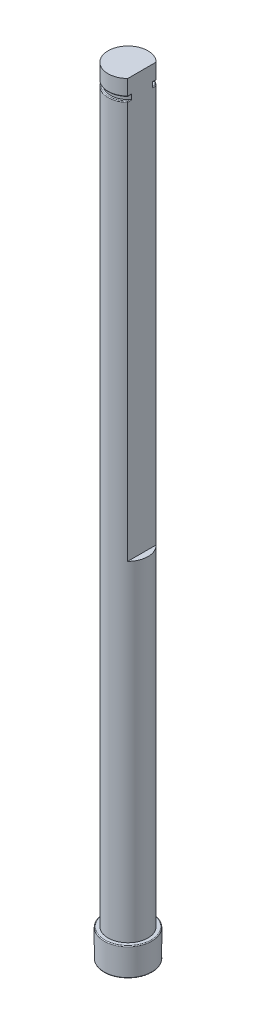
ISO-10303-21;
HEADER;
FILE_DESCRIPTION(('STEP AP214'),'2;1');
FILE_NAME('part.step','',(''),(''),'','','');
FILE_SCHEMA(('AUTOMOTIVE_DESIGN { 1 0 10303 214 1 1 1 1 }'));
ENDSEC;
DATA;
#1=APPLICATION_CONTEXT('core data for automotive mechanical design processes');
#2=APPLICATION_PROTOCOL_DEFINITION('international standard','automotive_design',2000,#1);
#3=PRODUCT_CONTEXT('',#1,'mechanical');
#4=PRODUCT('Part','Part','',(#3));
#5=PRODUCT_RELATED_PRODUCT_CATEGORY('part','',(#4));
#6=PRODUCT_DEFINITION_FORMATION('','',#4);
#7=PRODUCT_DEFINITION_CONTEXT('part definition',#1,'design');
#8=PRODUCT_DEFINITION('design','',#6,#7);
#9=PRODUCT_DEFINITION_SHAPE('','',#8);
#10=(LENGTH_UNIT() NAMED_UNIT(*) SI_UNIT(.MILLI.,.METRE.));
#11=(NAMED_UNIT(*) PLANE_ANGLE_UNIT() SI_UNIT($,.RADIAN.));
#12=(NAMED_UNIT(*) SI_UNIT($,.STERADIAN.) SOLID_ANGLE_UNIT());
#13=UNCERTAINTY_MEASURE_WITH_UNIT(LENGTH_MEASURE(1.E-05),#10,'distance_accuracy_value','');
#14=(GEOMETRIC_REPRESENTATION_CONTEXT(3) GLOBAL_UNCERTAINTY_ASSIGNED_CONTEXT((#13)) GLOBAL_UNIT_ASSIGNED_CONTEXT((#10,
#11,#12)) REPRESENTATION_CONTEXT('',''));
#15=CARTESIAN_POINT('',(0.,0.,0.));
#16=DIRECTION('',(0.,0.,1.));
#17=DIRECTION('',(1.,0.,0.));
#18=AXIS2_PLACEMENT_3D('',#15,#16,#17);
#19=CARTESIAN_POINT('',(0.,195.,0.));
#20=DIRECTION('',(0.,-1.,0.));
#21=DIRECTION('',(0.,0.,-1.));
#22=AXIS2_PLACEMENT_3D('',#19,#20,#21);
#23=CYLINDRICAL_SURFACE('',#22,5.);
#24=DIRECTION('',(0.,1.,0.));
#25=VECTOR('',#24,1.);
#26=CARTESIAN_POINT('',(3.5,90.,3.57071421427142));
#27=LINE('',#26,#25);
#28=CARTESIAN_POINT('',(3.5,90.,3.57071421427142));
#29=VERTEX_POINT('',#28);
#30=CARTESIAN_POINT('',(3.5,189.8,3.57071421427142));
#31=VERTEX_POINT('',#30);
#32=EDGE_CURVE('E157',#29,#31,#27,.T.);
#33=ORIENTED_EDGE('',*,*,#32,.T.);
#34=CARTESIAN_POINT('',(0.,189.8,0.));
#35=DIRECTION('',(0.,1.,0.));
#36=DIRECTION('',(0.,0.,1.));
#37=AXIS2_PLACEMENT_3D('',#34,#35,#36);
#38=CIRCLE('',#37,5.);
#39=CARTESIAN_POINT('',(3.5,189.8,-3.57071421427142));
#40=VERTEX_POINT('',#39);
#41=EDGE_CURVE('E163',#31,#40,#38,.F.);
#42=ORIENTED_EDGE('',*,*,#41,.T.);
#43=DIRECTION('',(0.,1.,0.));
#44=VECTOR('',#43,1.);
#45=CARTESIAN_POINT('',(3.5,90.,-3.57071421427142));
#46=LINE('',#45,#44);
#47=CARTESIAN_POINT('',(3.5,90.,-3.57071421427142));
#48=VERTEX_POINT('',#47);
#49=EDGE_CURVE('E155',#48,#40,#46,.T.);
#50=ORIENTED_EDGE('',*,*,#49,.F.);
#51=CARTESIAN_POINT('',(0.,90.,0.));
#52=DIRECTION('',(0.,1.,0.));
#53=DIRECTION('',(0.,0.,1.));
#54=AXIS2_PLACEMENT_3D('',#51,#52,#53);
#55=CIRCLE('',#54,5.);
#56=EDGE_CURVE('E140',#29,#48,#55,.T.);
#57=ORIENTED_EDGE('',*,*,#56,.F.);
#58=EDGE_LOOP('',(#33,#42,#50,#57));
#59=FACE_BOUND('',#58,.T.);
#60=CARTESIAN_POINT('',(0.,7.05,0.));
#61=DIRECTION('',(0.,-1.,0.));
#62=DIRECTION('',(0.,0.,-1.));
#63=AXIS2_PLACEMENT_3D('',#60,#61,#62);
#64=CIRCLE('',#63,5.);
#65=CARTESIAN_POINT('',(0.,7.05,-5.));
#66=VERTEX_POINT('',#65);
#67=EDGE_CURVE('E319',#66,#66,#64,.T.);
#68=ORIENTED_EDGE('',*,*,#67,.F.);
#69=EDGE_LOOP('',(#68));
#70=FACE_BOUND('',#69,.T.);
#71=ADVANCED_FACE('F49',(#59,#70),#23,.T.);
#72=CARTESIAN_POINT('',(3.5,191.2,-3.57071421427142));
#73=VERTEX_POINT('',#72);
#74=CARTESIAN_POINT('',(3.5,195.,-3.57071421427142));
#75=VERTEX_POINT('',#74);
#76=EDGE_CURVE('E159',#73,#75,#46,.T.);
#77=ORIENTED_EDGE('',*,*,#76,.F.);
#78=CARTESIAN_POINT('',(0.,191.2,0.));
#79=DIRECTION('',(0.,1.,0.));
#80=DIRECTION('',(0.,0.,1.));
#81=AXIS2_PLACEMENT_3D('',#78,#79,#80);
#82=CIRCLE('',#81,5.);
#83=CARTESIAN_POINT('',(3.5,191.2,3.57071421427142));
#84=VERTEX_POINT('',#83);
#85=EDGE_CURVE('E227',#73,#84,#82,.T.);
#86=ORIENTED_EDGE('',*,*,#85,.T.);
#87=CARTESIAN_POINT('',(3.5,195.,3.57071421427142));
#88=VERTEX_POINT('',#87);
#89=EDGE_CURVE('E165',#84,#88,#27,.T.);
#90=ORIENTED_EDGE('',*,*,#89,.T.);
#91=CARTESIAN_POINT('',(0.,195.,0.));
#92=DIRECTION('',(0.,1.,0.));
#93=DIRECTION('',(0.,0.,1.));
#94=AXIS2_PLACEMENT_3D('',#91,#92,#93);
#95=CIRCLE('',#94,5.);
#96=EDGE_CURVE('E194',#75,#88,#95,.T.);
#97=ORIENTED_EDGE('',*,*,#96,.F.);
#98=EDGE_LOOP('',(#77,#86,#90,#97));
#99=FACE_BOUND('',#98,.T.);
#100=ADVANCED_FACE('F260',(#99),#23,.T.);
#101=CARTESIAN_POINT('',(0.,195.,0.));
#102=DIRECTION('',(0.,1.,0.));
#103=DIRECTION('',(0.,0.,1.));
#104=AXIS2_PLACEMENT_3D('',#101,#102,#103);
#105=PLANE('',#104);
#106=DIRECTION('',(0.,0.,1.));
#107=VECTOR('',#106,1.);
#108=CARTESIAN_POINT('',(3.5,195.,0.));
#109=LINE('',#108,#107);
#110=EDGE_CURVE('E148',#75,#88,#109,.T.);
#111=ORIENTED_EDGE('',*,*,#110,.F.);
#112=ORIENTED_EDGE('',*,*,#96,.T.);
#113=EDGE_LOOP('',(#111,#112));
#114=FACE_BOUND('',#113,.T.);
#115=ADVANCED_FACE('F364',(#114),#105,.T.);
#116=CARTESIAN_POINT('',(3.5,90.,0.));
#117=DIRECTION('',(-1.,0.,0.));
#118=DIRECTION('',(0.,0.,1.));
#119=AXIS2_PLACEMENT_3D('',#116,#117,#118);
#120=PLANE('',#119);
#121=ORIENTED_EDGE('',*,*,#89,.F.);
#122=DIRECTION('',(0.,0.,-1.));
#123=VECTOR('',#122,1.);
#124=CARTESIAN_POINT('',(3.5,191.2,0.));
#125=LINE('',#124,#123);
#126=CARTESIAN_POINT('',(3.5,191.2,2.66645832519468));
#127=VERTEX_POINT('',#126);
#128=EDGE_CURVE('E207',#84,#127,#125,.T.);
#129=ORIENTED_EDGE('',*,*,#128,.T.);
#130=DIRECTION('',(0.,-1.,0.));
#131=VECTOR('',#130,1.);
#132=CARTESIAN_POINT('',(3.5,191.,2.66645832519468));
#133=LINE('',#132,#131);
#134=CARTESIAN_POINT('',(3.5,189.8,2.66645832519468));
#135=VERTEX_POINT('',#134);
#136=EDGE_CURVE('E323',#127,#135,#133,.T.);
#137=ORIENTED_EDGE('',*,*,#136,.T.);
#138=DIRECTION('',(0.,0.,-1.));
#139=VECTOR('',#138,1.);
#140=CARTESIAN_POINT('',(3.5,189.8,3.57071421427142));
#141=LINE('',#140,#139);
#142=EDGE_CURVE('E204',#135,#31,#141,.F.);
#143=ORIENTED_EDGE('',*,*,#142,.T.);
#144=ORIENTED_EDGE('',*,*,#32,.F.);
#145=DIRECTION('',(0.,0.,1.));
#146=VECTOR('',#145,1.);
#147=CARTESIAN_POINT('',(3.5,90.,0.));
#148=LINE('',#147,#146);
#149=EDGE_CURVE('E143',#48,#29,#148,.T.);
#150=ORIENTED_EDGE('',*,*,#149,.F.);
#151=ORIENTED_EDGE('',*,*,#49,.T.);
#152=DIRECTION('',(0.,0.,-1.));
#153=VECTOR('',#152,1.);
#154=CARTESIAN_POINT('',(3.5,189.8,-2.66645832519468));
#155=LINE('',#154,#153);
#156=CARTESIAN_POINT('',(3.5,189.8,-2.66645832519468));
#157=VERTEX_POINT('',#156);
#158=EDGE_CURVE('E198',#40,#157,#155,.F.);
#159=ORIENTED_EDGE('',*,*,#158,.T.);
#160=DIRECTION('',(0.,-1.,0.));
#161=VECTOR('',#160,1.);
#162=CARTESIAN_POINT('',(3.5,191.,-2.66645832519468));
#163=LINE('',#162,#161);
#164=CARTESIAN_POINT('',(3.5,191.2,-2.66645832519468));
#165=VERTEX_POINT('',#164);
#166=EDGE_CURVE('E384',#165,#157,#163,.T.);
#167=ORIENTED_EDGE('',*,*,#166,.F.);
#168=DIRECTION('',(0.,0.,-1.));
#169=VECTOR('',#168,1.);
#170=CARTESIAN_POINT('',(3.5,191.2,0.));
#171=LINE('',#170,#169);
#172=EDGE_CURVE('E201',#165,#73,#171,.T.);
#173=ORIENTED_EDGE('',*,*,#172,.T.);
#174=ORIENTED_EDGE('',*,*,#76,.T.);
#175=ORIENTED_EDGE('',*,*,#110,.T.);
#176=EDGE_LOOP('',(#121,#129,#137,#143,#144,#150,#151,#159,#167,#173,#174,#175));
#177=FACE_BOUND('',#176,.T.);
#178=ADVANCED_FACE('F153',(#177),#120,.F.);
#179=CARTESIAN_POINT('',(0.,90.,0.));
#180=DIRECTION('',(0.,1.,0.));
#181=DIRECTION('',(0.,0.,1.));
#182=AXIS2_PLACEMENT_3D('',#179,#180,#181);
#183=PLANE('',#182);
#184=ORIENTED_EDGE('',*,*,#56,.T.);
#185=ORIENTED_EDGE('',*,*,#149,.T.);
#186=EDGE_LOOP('',(#184,#185));
#187=FACE_BOUND('',#186,.T.);
#188=ADVANCED_FACE('F142',(#187),#183,.T.);
#189=CARTESIAN_POINT('',(0.,191.,0.));
#190=DIRECTION('',(0.,-1.,0.));
#191=DIRECTION('',(0.,0.,-1.));
#192=AXIS2_PLACEMENT_3D('',#189,#190,#191);
#193=CYLINDRICAL_SURFACE('',#192,4.4);
#194=ORIENTED_EDGE('',*,*,#166,.T.);
#195=CARTESIAN_POINT('',(3.5,189.8,-2.66645832519468));
#196=CARTESIAN_POINT('',(3.50001572959241,189.808340122319,-2.66643640554394));
#197=CARTESIAN_POINT('',(3.4994794322201,189.816645047938,-2.66714170397318));
#198=CARTESIAN_POINT('',(3.49744914980149,189.83282973883,-2.66980408832565));
#199=CARTESIAN_POINT('',(3.49596704452966,189.840713481461,-2.67174564561712));
#200=CARTESIAN_POINT('',(3.49219437276219,189.855882112243,-2.67667468311572));
#201=CARTESIAN_POINT('',(3.48990775386464,189.863169714122,-2.67965705566883));
#202=CARTESIAN_POINT('',(3.48468414896616,189.877118941027,-2.68644653944985));
#203=CARTESIAN_POINT('',(3.48174501247574,189.883778389985,-2.69025637681479));
#204=CARTESIAN_POINT('',(3.47355573391022,189.900008437893,-2.70082882140916));
#205=CARTESIAN_POINT('',(3.46793819926475,189.909097609841,-2.70804344153626));
#206=CARTESIAN_POINT('',(3.45585807060967,189.925755486826,-2.72344302343464));
#207=CARTESIAN_POINT('',(3.44939357226424,189.93332066498,-2.73163016786257));
#208=CARTESIAN_POINT('',(3.43211600590083,189.950899805874,-2.75333661388643));
#209=CARTESIAN_POINT('',(3.42087785925408,189.959948582211,-2.76729720347348));
#210=CARTESIAN_POINT('',(3.39747563270114,189.975195792089,-2.7959802184265));
#211=CARTESIAN_POINT('',(3.38530944990888,189.981387513773,-2.81070434824145));
#212=CARTESIAN_POINT('',(3.36107279881261,189.990866149937,-2.83963440052699));
#213=CARTESIAN_POINT('',(3.34903654530551,189.994298764035,-2.85382189393174));
#214=CARTESIAN_POINT('',(3.32469473999505,189.998847187677,-2.88214451604545));
#215=CARTESIAN_POINT('',(3.31239200195113,189.999980765003,-2.89627919705817));
#216=CARTESIAN_POINT('',(3.3,190.,-2.91032644217105));
#217=B_SPLINE_CURVE_WITH_KNOTS('',3,(#195,#196,#197,#198,#199,#200,#201,#202,#203,#204,#205,
#206,#207,#208,#209,#210,#211,#212,#213,#214,#215,#216),.UNSPECIFIED.,.F.,.F.,(4,2,2,2,2,2,2,2,
2,2,4),(0.,0.0249177085251996,0.0495284395601784,0.0740200568533302,0.0985936216132089,
0.137053189663758,0.175600764822114,0.235503299305906,0.295545850562678,0.352159352585193,
0.408333631850799),.UNSPECIFIED.);
#218=CARTESIAN_POINT('',(3.3,190.,-2.91032644217105));
#219=VERTEX_POINT('',#218);
#220=EDGE_CURVE('E277',#157,#219,#217,.T.);
#221=ORIENTED_EDGE('',*,*,#220,.T.);
#222=CARTESIAN_POINT('',(0.,190.,0.));
#223=DIRECTION('',(0.,1.,0.));
#224=DIRECTION('',(0.,0.,1.));
#225=AXIS2_PLACEMENT_3D('',#222,#223,#224);
#226=CIRCLE('',#225,4.4);
#227=CARTESIAN_POINT('',(3.3,190.,2.91032644217105));
#228=VERTEX_POINT('',#227);
#229=EDGE_CURVE('E290',#219,#228,#226,.T.);
#230=ORIENTED_EDGE('',*,*,#229,.T.);
#231=CARTESIAN_POINT('',(3.3,190.,2.91032644217105));
#232=CARTESIAN_POINT('',(3.30847190666142,189.999995855485,2.90072037980732));
#233=CARTESIAN_POINT('',(3.31689429232194,189.999462097017,2.89108536199942));
#234=CARTESIAN_POINT('',(3.33360904440519,189.997336862343,2.87179632769245));
#235=CARTESIAN_POINT('',(3.34190122018778,189.99574396082,2.86214230309417));
#236=CARTESIAN_POINT('',(3.36665779349885,189.989340592568,2.83306597750165));
#237=CARTESIAN_POINT('',(3.38283903785468,189.98290543495,2.81371459139366));
#238=CARTESIAN_POINT('',(3.40813355912034,189.968623074177,2.78296011017199));
#239=CARTESIAN_POINT('',(3.41766366547705,189.962157872184,2.7712433915368));
#240=CARTESIAN_POINT('',(3.43593526326525,189.947176225576,2.74855567544082));
#241=CARTESIAN_POINT('',(3.44467929474056,189.938666740021,2.73758230657741));
#242=CARTESIAN_POINT('',(3.45840670987927,189.922399023565,2.72020300256407));
#243=CARTESIAN_POINT('',(3.46369981678297,189.915267390093,2.71345688038355));
#244=CARTESIAN_POINT('',(3.47355436797752,189.899813095747,2.70083018049558));
#245=CARTESIAN_POINT('',(3.47811663408155,189.891491792847,2.69494863121841));
#246=CARTESIAN_POINT('',(3.48516068862098,189.875948160981,2.68582934950566));
#247=CARTESIAN_POINT('',(3.48787495829382,189.869002991741,2.68230186537504));
#248=CARTESIAN_POINT('',(3.49258107999117,189.854500873333,2.67617119159258));
#249=CARTESIAN_POINT('',(3.4945752152582,189.846945952328,2.67356508121489));
#250=CARTESIAN_POINT('',(3.49738424333156,189.832867949587,2.66988914128382));
#251=CARTESIAN_POINT('',(3.49835268101703,189.82642820271,2.66861958587353));
#252=CARTESIAN_POINT('',(3.49966642602793,189.813331125213,2.66689618824022));
#253=CARTESIAN_POINT('',(3.50000706482059,189.806672536283,2.6664484574925));
#254=CARTESIAN_POINT('',(3.5,189.8,2.66645832519468));
#255=B_SPLINE_CURVE_WITH_KNOTS('',3,(#231,#232,#233,#234,#235,#236,#237,#238,#239,#240,#241,
#242,#243,#244,#245,#246,#247,#248,#249,#250,#251,#252,#253,#254),.UNSPECIFIED.,.F.,.F.,(4,2,2,
2,2,2,2,2,2,2,2,4),(0.,0.0383917197041354,0.0768352090068305,0.154454266571866,
0.203624652584167,0.252629969364985,0.285999301981336,0.319330844108165,0.343992336355992,
0.368574936307704,0.388399211678346,0.408370321543629),.UNSPECIFIED.);
#256=EDGE_CURVE('E241',#228,#135,#255,.T.);
#257=ORIENTED_EDGE('',*,*,#256,.T.);
#258=ORIENTED_EDGE('',*,*,#136,.F.);
#259=CARTESIAN_POINT('',(3.5,191.2,2.66645832519468));
#260=CARTESIAN_POINT('',(3.50001572959241,191.191659877681,2.66643640554394));
#261=CARTESIAN_POINT('',(3.4994794322201,191.183354952062,2.66714170397318));
#262=CARTESIAN_POINT('',(3.49744914980149,191.16717026117,2.66980408832566));
#263=CARTESIAN_POINT('',(3.49596704452966,191.159286518539,2.67174564561712));
#264=CARTESIAN_POINT('',(3.49219437276219,191.144117887757,2.67667468311573));
#265=CARTESIAN_POINT('',(3.48990775386463,191.136830285878,2.67965705566884));
#266=CARTESIAN_POINT('',(3.48468414896615,191.122881058973,2.68644653944987));
#267=CARTESIAN_POINT('',(3.48174501247574,191.116221610015,2.6902563768148));
#268=CARTESIAN_POINT('',(3.47355573391022,191.099991562107,2.70082882140917));
#269=CARTESIAN_POINT('',(3.46793819926475,191.090902390159,2.70804344153626));
#270=CARTESIAN_POINT('',(3.45585807060967,191.074244513174,2.72344302343464));
#271=CARTESIAN_POINT('',(3.44939357226424,191.06667933502,2.73163016786257));
#272=CARTESIAN_POINT('',(3.43211600590083,191.049100194126,2.75333661388643));
#273=CARTESIAN_POINT('',(3.42087785925408,191.040051417789,2.76729720347349));
#274=CARTESIAN_POINT('',(3.39747563270113,191.024804207911,2.79598021842651));
#275=CARTESIAN_POINT('',(3.38530944990888,191.018612486227,2.81070434824146));
#276=CARTESIAN_POINT('',(3.36107279881261,191.009133850063,2.83963440052699));
#277=CARTESIAN_POINT('',(3.34903654530551,191.005701235965,2.85382189393174));
#278=CARTESIAN_POINT('',(3.32469473999505,191.001152812323,2.88214451604545));
#279=CARTESIAN_POINT('',(3.31239200195113,191.000019234997,2.89627919705818));
#280=CARTESIAN_POINT('',(3.3,191.,2.91032644217105));
#281=B_SPLINE_CURVE_WITH_KNOTS('',3,(#259,#260,#261,#262,#263,#264,#265,#266,#267,#268,#269,
#270,#271,#272,#273,#274,#275,#276,#277,#278,#279,#280),.UNSPECIFIED.,.F.,.F.,(4,2,2,2,2,2,2,2,
2,2,4),(0.,0.0249177085251996,0.0495284395601784,0.0740200568533909,0.0985936216132101,
0.137053189663759,0.175600764822115,0.235503299305923,0.295545850562678,0.352159352585193,
0.408333631850799),.UNSPECIFIED.);
#282=CARTESIAN_POINT('',(3.3,191.,2.91032644217105));
#283=VERTEX_POINT('',#282);
#284=EDGE_CURVE('E232',#127,#283,#281,.T.);
#285=ORIENTED_EDGE('',*,*,#284,.T.);
#286=CARTESIAN_POINT('',(0.,191.,0.));
#287=DIRECTION('',(0.,1.,0.));
#288=DIRECTION('',(0.,0.,1.));
#289=AXIS2_PLACEMENT_3D('',#286,#287,#288);
#290=CIRCLE('',#289,4.4);
#291=CARTESIAN_POINT('',(3.3,191.,-2.91032644217105));
#292=VERTEX_POINT('',#291);
#293=EDGE_CURVE('E390',#292,#283,#290,.T.);
#294=ORIENTED_EDGE('',*,*,#293,.F.);
#295=CARTESIAN_POINT('',(3.3,191.,-2.91032644217105));
#296=CARTESIAN_POINT('',(3.30847190666142,191.000004144515,-2.90072037980732));
#297=CARTESIAN_POINT('',(3.31689429232194,191.000537902983,-2.89108536199942));
#298=CARTESIAN_POINT('',(3.33360904440519,191.002663137657,-2.87179632769245));
#299=CARTESIAN_POINT('',(3.34190122018778,191.00425603918,-2.86214230309417));
#300=CARTESIAN_POINT('',(3.36665779349885,191.010659407432,-2.83306597750165));
#301=CARTESIAN_POINT('',(3.38283903785468,191.01709456505,-2.81371459139366));
#302=CARTESIAN_POINT('',(3.40813355912034,191.031376925823,-2.78296011017199));
#303=CARTESIAN_POINT('',(3.41766366547705,191.037842127816,-2.7712433915368));
#304=CARTESIAN_POINT('',(3.43593526326525,191.052823774424,-2.74855567544082));
#305=CARTESIAN_POINT('',(3.44467929474056,191.061333259979,-2.73758230657741));
#306=CARTESIAN_POINT('',(3.45840670987928,191.077600976435,-2.72020300256406));
#307=CARTESIAN_POINT('',(3.46369981678298,191.084732609907,-2.71345688038354));
#308=CARTESIAN_POINT('',(3.47355436797753,191.100186904253,-2.70083018049556));
#309=CARTESIAN_POINT('',(3.47811663408155,191.108508207153,-2.6949486312184));
#310=CARTESIAN_POINT('',(3.48516068862098,191.124051839019,-2.68582934950566));
#311=CARTESIAN_POINT('',(3.48787495829382,191.130997008259,-2.68230186537504));
#312=CARTESIAN_POINT('',(3.49258107999117,191.145499126667,-2.67617119159258));
#313=CARTESIAN_POINT('',(3.4945752152582,191.153054047672,-2.67356508121489));
#314=CARTESIAN_POINT('',(3.49738424333156,191.167132050413,-2.66988914128382));
#315=CARTESIAN_POINT('',(3.49835268101703,191.17357179729,-2.66861958587353));
#316=CARTESIAN_POINT('',(3.49966642602793,191.186668874787,-2.66689618824022));
#317=CARTESIAN_POINT('',(3.50000706482059,191.193327463717,-2.6664484574925));
#318=CARTESIAN_POINT('',(3.5,191.2,-2.66645832519468));
#319=B_SPLINE_CURVE_WITH_KNOTS('',3,(#295,#296,#297,#298,#299,#300,#301,#302,#303,#304,#305,
#306,#307,#308,#309,#310,#311,#312,#313,#314,#315,#316,#317,#318),.UNSPECIFIED.,.F.,.F.,(4,2,2,
2,2,2,2,2,2,2,2,4),(0.,0.0383917197041332,0.0768352090068304,0.154454266571866,
0.203624652584167,0.252629969364985,0.285999301981375,0.319330844108165,0.343992336355992,
0.368574936307704,0.388399211678346,0.408370321543628),.UNSPECIFIED.);
#320=EDGE_CURVE('E306',#292,#165,#319,.T.);
#321=ORIENTED_EDGE('',*,*,#320,.T.);
#322=EDGE_LOOP('',(#194,#221,#230,#257,#258,#285,#294,#321));
#323=FACE_BOUND('',#322,.T.);
#324=ADVANCED_FACE('F248',(#323),#193,.T.);
#325=CARTESIAN_POINT('',(0.,191.,0.));
#326=DIRECTION('',(0.,1.,0.));
#327=DIRECTION('',(0.,0.,1.));
#328=AXIS2_PLACEMENT_3D('',#325,#326,#327);
#329=PLANE('',#328);
#330=ORIENTED_EDGE('',*,*,#293,.T.);
#331=DIRECTION('',(0.,0.,-1.));
#332=VECTOR('',#331,1.);
#333=CARTESIAN_POINT('',(3.3,191.,0.));
#334=LINE('',#333,#332);
#335=CARTESIAN_POINT('',(3.3,191.,3.48568501158667));
#336=VERTEX_POINT('',#335);
#337=EDGE_CURVE('E217',#283,#336,#334,.F.);
#338=ORIENTED_EDGE('',*,*,#337,.T.);
#339=CARTESIAN_POINT('',(0.,191.,0.));
#340=DIRECTION('',(0.,1.,0.));
#341=DIRECTION('',(0.,0.,1.));
#342=AXIS2_PLACEMENT_3D('',#339,#340,#341);
#343=CIRCLE('',#342,4.8);
#344=CARTESIAN_POINT('',(3.3,191.,-3.48568501158668));
#345=VERTEX_POINT('',#344);
#346=EDGE_CURVE('E211',#336,#345,#343,.F.);
#347=ORIENTED_EDGE('',*,*,#346,.T.);
#348=DIRECTION('',(0.,0.,-1.));
#349=VECTOR('',#348,1.);
#350=CARTESIAN_POINT('',(3.3,191.,0.));
#351=LINE('',#350,#349);
#352=EDGE_CURVE('E214',#345,#292,#351,.F.);
#353=ORIENTED_EDGE('',*,*,#352,.T.);
#354=EDGE_LOOP('',(#330,#338,#347,#353));
#355=FACE_BOUND('',#354,.T.);
#356=ADVANCED_FACE('F396',(#355),#329,.F.);
#357=CARTESIAN_POINT('',(0.,190.,0.));
#358=DIRECTION('',(0.,1.,0.));
#359=DIRECTION('',(0.,0.,1.));
#360=AXIS2_PLACEMENT_3D('',#357,#358,#359);
#361=PLANE('',#360);
#362=CARTESIAN_POINT('',(0.,190.,0.));
#363=DIRECTION('',(0.,1.,0.));
#364=DIRECTION('',(0.,0.,1.));
#365=AXIS2_PLACEMENT_3D('',#362,#363,#364);
#366=CIRCLE('',#365,4.8);
#367=CARTESIAN_POINT('',(3.3,190.,-3.48568501158668));
#368=VERTEX_POINT('',#367);
#369=CARTESIAN_POINT('',(3.3,190.,3.48568501158667));
#370=VERTEX_POINT('',#369);
#371=EDGE_CURVE('E65',#368,#370,#366,.T.);
#372=ORIENTED_EDGE('',*,*,#371,.T.);
#373=DIRECTION('',(0.,0.,-1.));
#374=VECTOR('',#373,1.);
#375=CARTESIAN_POINT('',(3.3,190.,2.66645832519468));
#376=LINE('',#375,#374);
#377=EDGE_CURVE('E224',#370,#228,#376,.T.);
#378=ORIENTED_EDGE('',*,*,#377,.T.);
#379=ORIENTED_EDGE('',*,*,#229,.F.);
#380=DIRECTION('',(0.,0.,-1.));
#381=VECTOR('',#380,1.);
#382=CARTESIAN_POINT('',(3.3,190.,-3.57071421427142));
#383=LINE('',#382,#381);
#384=EDGE_CURVE('E70',#219,#368,#383,.T.);
#385=ORIENTED_EDGE('',*,*,#384,.T.);
#386=EDGE_LOOP('',(#372,#378,#379,#385));
#387=FACE_BOUND('',#386,.T.);
#388=ADVANCED_FACE('F301',(#387),#361,.T.);
#389=CARTESIAN_POINT('',(3.3,191.2,0.));
#390=DIRECTION('',(0.,0.,-1.));
#391=DIRECTION('',(-1.,0.,0.));
#392=AXIS2_PLACEMENT_3D('',#389,#390,#391);
#393=CYLINDRICAL_SURFACE('',#392,0.2);
#394=ORIENTED_EDGE('',*,*,#320,.F.);
#395=ORIENTED_EDGE('',*,*,#352,.F.);
#396=CARTESIAN_POINT('',(3.5,191.2,-3.57071421427142));
#397=CARTESIAN_POINT('',(3.50001202853429,191.189382809665,-3.57071906284533));
#398=CARTESIAN_POINT('',(3.49915539882841,191.178773469745,-3.5703594095157));
#399=CARTESIAN_POINT('',(3.49579916765285,191.157894872728,-3.56894919847386));
#400=CARTESIAN_POINT('',(3.49330422944727,191.147624737012,-3.56790060175822));
#401=CARTESIAN_POINT('',(3.48676567383597,191.127688181021,-3.56515059809789));
#402=CARTESIAN_POINT('',(3.48272248587823,191.1180215942,-3.56344937217692));
#403=CARTESIAN_POINT('',(3.47324393907842,191.099528674918,-3.55945723610596));
#404=CARTESIAN_POINT('',(3.46780805280431,191.090702662535,-3.55716610254903));
#405=CARTESIAN_POINT('',(3.45553926758007,191.073826283551,-3.55198883506433));
#406=CARTESIAN_POINT('',(3.44866772485282,191.065809147366,-3.54908621848259));
#407=CARTESIAN_POINT('',(3.43386176614913,191.051035265076,-3.54282304109022));
#408=CARTESIAN_POINT('',(3.42592699164064,191.044278945977,-3.53946232579764));
#409=CARTESIAN_POINT('',(3.40859947071133,191.031687223387,-3.53211167438113));
#410=CARTESIAN_POINT('',(3.39914226821589,191.025957080457,-3.52809357129958));
#411=CARTESIAN_POINT('',(3.37952729270225,191.016164185875,-3.51974420815357));
#412=CARTESIAN_POINT('',(3.3693693103298,191.012101935038,-3.51541285448834));
#413=CARTESIAN_POINT('',(3.34988928019782,191.006087736977,-3.50709039062174));
#414=CARTESIAN_POINT('',(3.34061718964717,191.003938286675,-3.50312256568254));
#415=CARTESIAN_POINT('',(3.32191154981102,191.00097924408,-3.49510381226007));
#416=CARTESIAN_POINT('',(3.31247833632011,191.000167143974,-3.49105305377615));
#417=CARTESIAN_POINT('',(3.30203250822153,191.000007729618,-3.48655958215352));
#418=CARTESIAN_POINT('',(3.30101617405265,190.999999981842,-3.48612230398671));
#419=CARTESIAN_POINT('',(3.3,191.,-3.48568501158668));
#420=B_SPLINE_CURVE_WITH_KNOTS('',3,(#396,#397,#398,#399,#400,#401,#402,#403,#404,#405,#406,
#407,#408,#409,#410,#411,#412,#413,#414,#415,#416,#417,#418,#419),.UNSPECIFIED.,.F.,.F.,(4,2,2,
2,2,2,2,2,2,2,2,4),(0.,0.0317988173652862,0.0635075129832495,0.0952074197200754,
0.126919349394092,0.159631156340529,0.192354021915409,0.227500341683072,0.262657207078275,
0.293508931495432,0.324302736257746,0.327621926842851),.UNSPECIFIED.);
#421=EDGE_CURVE('E275',#73,#345,#420,.T.);
#422=ORIENTED_EDGE('',*,*,#421,.F.);
#423=ORIENTED_EDGE('',*,*,#172,.F.);
#424=EDGE_LOOP('',(#394,#395,#422,#423));
#425=FACE_BOUND('',#424,.T.);
#426=ADVANCED_FACE('F298',(#425),#393,.T.);
#427=CARTESIAN_POINT('',(0.,191.2,0.));
#428=DIRECTION('',(0.,1.,0.));
#429=DIRECTION('',(0.,0.,1.));
#430=AXIS2_PLACEMENT_3D('',#427,#428,#429);
#431=TOROIDAL_SURFACE('',#430,4.8,0.2);
#432=ORIENTED_EDGE('',*,*,#421,.T.);
#433=ORIENTED_EDGE('',*,*,#346,.F.);
#434=CARTESIAN_POINT('',(3.5,191.2,3.57071421427142));
#435=CARTESIAN_POINT('',(3.50001202853429,191.189382809665,3.57071906284533));
#436=CARTESIAN_POINT('',(3.49915539882841,191.178773469745,3.5703594095157));
#437=CARTESIAN_POINT('',(3.49579916765285,191.157894872728,3.56894919847386));
#438=CARTESIAN_POINT('',(3.49330422944727,191.147624737012,3.56790060175822));
#439=CARTESIAN_POINT('',(3.48676567383597,191.127688181021,3.56515059809789));
#440=CARTESIAN_POINT('',(3.48272248587823,191.1180215942,3.56344937217692));
#441=CARTESIAN_POINT('',(3.47324393907842,191.099528674918,3.55945723610596));
#442=CARTESIAN_POINT('',(3.46780805280431,191.090702662535,3.55716610254903));
#443=CARTESIAN_POINT('',(3.45553926758007,191.073826283551,3.55198883506433));
#444=CARTESIAN_POINT('',(3.44866772485282,191.065809147366,3.54908621848259));
#445=CARTESIAN_POINT('',(3.43386176614913,191.051035265076,3.54282304109022));
#446=CARTESIAN_POINT('',(3.42592699164064,191.044278945977,3.53946232579764));
#447=CARTESIAN_POINT('',(3.40859947071133,191.031687223387,3.53211167438113));
#448=CARTESIAN_POINT('',(3.39914226821589,191.025957080457,3.52809357129958));
#449=CARTESIAN_POINT('',(3.37952729270225,191.016164185875,3.51974420815357));
#450=CARTESIAN_POINT('',(3.3693693103298,191.012101935038,3.51541285448834));
#451=CARTESIAN_POINT('',(3.34988928019782,191.006087736977,3.50709039062174));
#452=CARTESIAN_POINT('',(3.34061718964717,191.003938286675,3.50312256568254));
#453=CARTESIAN_POINT('',(3.32191154981102,191.00097924408,3.49510381226007));
#454=CARTESIAN_POINT('',(3.31247833632011,191.000167143974,3.49105305377615));
#455=CARTESIAN_POINT('',(3.30203250822153,191.000007729618,3.48655958215352));
#456=CARTESIAN_POINT('',(3.30101617405265,190.999999981842,3.48612230398671));
#457=CARTESIAN_POINT('',(3.3,191.,3.48568501158668));
#458=B_SPLINE_CURVE_WITH_KNOTS('',3,(#434,#435,#436,#437,#438,#439,#440,#441,#442,#443,#444,
#445,#446,#447,#448,#449,#450,#451,#452,#453,#454,#455,#456,#457),.UNSPECIFIED.,.F.,.F.,(4,2,2,
2,2,2,2,2,2,2,2,4),(0.,0.0317988173652862,0.0635075129832495,0.0952074197200754,
0.126919349394092,0.159631156340529,0.192354021915409,0.227500341683072,0.262657207078275,
0.293508931495432,0.324302736257746,0.327621926842851),.UNSPECIFIED.);
#459=EDGE_CURVE('E266',#84,#336,#458,.T.);
#460=ORIENTED_EDGE('',*,*,#459,.F.);
#461=ORIENTED_EDGE('',*,*,#85,.F.);
#462=EDGE_LOOP('',(#432,#433,#460,#461));
#463=FACE_BOUND('',#462,.T.);
#464=ADVANCED_FACE('F258',(#463),#431,.T.);
#465=CARTESIAN_POINT('',(3.3,191.2,0.));
#466=DIRECTION('',(0.,0.,-1.));
#467=DIRECTION('',(-1.,0.,0.));
#468=AXIS2_PLACEMENT_3D('',#465,#466,#467);
#469=CYLINDRICAL_SURFACE('',#468,0.2);
#470=ORIENTED_EDGE('',*,*,#459,.T.);
#471=ORIENTED_EDGE('',*,*,#337,.F.);
#472=ORIENTED_EDGE('',*,*,#284,.F.);
#473=ORIENTED_EDGE('',*,*,#128,.F.);
#474=EDGE_LOOP('',(#470,#471,#472,#473));
#475=FACE_BOUND('',#474,.T.);
#476=ADVANCED_FACE('F252',(#475),#469,.T.);
#477=CARTESIAN_POINT('',(3.3,189.8,0.));
#478=DIRECTION('',(0.,0.,1.));
#479=DIRECTION('',(1.,0.,0.));
#480=AXIS2_PLACEMENT_3D('',#477,#478,#479);
#481=CYLINDRICAL_SURFACE('',#480,0.2);
#482=ORIENTED_EDGE('',*,*,#220,.F.);
#483=ORIENTED_EDGE('',*,*,#158,.F.);
#484=CARTESIAN_POINT('',(3.5,189.8,-3.57071421427142));
#485=CARTESIAN_POINT('',(3.50001202853429,189.810617190335,-3.57071906284533));
#486=CARTESIAN_POINT('',(3.49915539882841,189.821226530255,-3.5703594095157));
#487=CARTESIAN_POINT('',(3.49579916765285,189.842105127272,-3.56894919847386));
#488=CARTESIAN_POINT('',(3.49330422944727,189.852375262988,-3.56790060175822));
#489=CARTESIAN_POINT('',(3.48676567383597,189.872311818979,-3.56515059809789));
#490=CARTESIAN_POINT('',(3.48272248587823,189.8819784058,-3.56344937217692));
#491=CARTESIAN_POINT('',(3.47324393907842,189.900471325082,-3.55945723610596));
#492=CARTESIAN_POINT('',(3.46780805280431,189.909297337465,-3.55716610254903));
#493=CARTESIAN_POINT('',(3.45553926758007,189.926173716449,-3.55198883506433));
#494=CARTESIAN_POINT('',(3.44866772485282,189.934190852634,-3.54908621848259));
#495=CARTESIAN_POINT('',(3.43386176614913,189.948964734924,-3.54282304109022));
#496=CARTESIAN_POINT('',(3.42592699164064,189.955721054023,-3.53946232579764));
#497=CARTESIAN_POINT('',(3.40859947071133,189.968312776613,-3.53211167438113));
#498=CARTESIAN_POINT('',(3.39914226821589,189.974042919543,-3.52809357129958));
#499=CARTESIAN_POINT('',(3.37952729270225,189.983835814125,-3.51974420815357));
#500=CARTESIAN_POINT('',(3.3693693103298,189.987898064962,-3.51541285448834));
#501=CARTESIAN_POINT('',(3.34988928019782,189.993912263023,-3.50709039062174));
#502=CARTESIAN_POINT('',(3.34061718964717,189.996061713325,-3.50312256568254));
#503=CARTESIAN_POINT('',(3.32191154981102,189.99902075592,-3.49510381226007));
#504=CARTESIAN_POINT('',(3.31247833632011,189.999832856026,-3.49105305377615));
#505=CARTESIAN_POINT('',(3.30203250822153,189.999992270382,-3.48655958215352));
#506=CARTESIAN_POINT('',(3.30101617405265,190.000000018158,-3.48612230398671));
#507=CARTESIAN_POINT('',(3.3,190.,-3.48568501158668));
#508=B_SPLINE_CURVE_WITH_KNOTS('',3,(#484,#485,#486,#487,#488,#489,#490,#491,#492,#493,#494,
#495,#496,#497,#498,#499,#500,#501,#502,#503,#504,#505,#506,#507),.UNSPECIFIED.,.F.,.F.,(4,2,2,
2,2,2,2,2,2,2,2,4),(0.,0.0317988173652862,0.0635075129832495,0.0952074197200754,
0.126919349394092,0.159631156340529,0.192354021915409,0.227500341683072,0.262657207078275,
0.293508931495432,0.324302736257746,0.327621926842851),.UNSPECIFIED.);
#509=EDGE_CURVE('E276',#368,#40,#508,.F.);
#510=ORIENTED_EDGE('',*,*,#509,.F.);
#511=ORIENTED_EDGE('',*,*,#384,.F.);
#512=EDGE_LOOP('',(#482,#483,#510,#511));
#513=FACE_BOUND('',#512,.T.);
#514=ADVANCED_FACE('F257',(#513),#481,.T.);
#515=CARTESIAN_POINT('',(0.,189.8,0.));
#516=DIRECTION('',(0.,1.,0.));
#517=DIRECTION('',(0.,0.,1.));
#518=AXIS2_PLACEMENT_3D('',#515,#516,#517);
#519=TOROIDAL_SURFACE('',#518,4.8,0.2);
#520=ORIENTED_EDGE('',*,*,#509,.T.);
#521=ORIENTED_EDGE('',*,*,#41,.F.);
#522=CARTESIAN_POINT('',(3.5,189.8,3.57071421427142));
#523=CARTESIAN_POINT('',(3.50001202853429,189.810617190335,3.57071906284533));
#524=CARTESIAN_POINT('',(3.49915539882841,189.821226530255,3.5703594095157));
#525=CARTESIAN_POINT('',(3.49579916765285,189.842105127272,3.56894919847386));
#526=CARTESIAN_POINT('',(3.49330422944727,189.852375262988,3.56790060175822));
#527=CARTESIAN_POINT('',(3.48676567383597,189.872311818979,3.56515059809789));
#528=CARTESIAN_POINT('',(3.48272248587823,189.8819784058,3.56344937217692));
#529=CARTESIAN_POINT('',(3.47324393907842,189.900471325082,3.55945723610596));
#530=CARTESIAN_POINT('',(3.46780805280431,189.909297337465,3.55716610254903));
#531=CARTESIAN_POINT('',(3.45553926758007,189.926173716449,3.55198883506433));
#532=CARTESIAN_POINT('',(3.44866772485282,189.934190852634,3.54908621848259));
#533=CARTESIAN_POINT('',(3.43386176614913,189.948964734924,3.54282304109022));
#534=CARTESIAN_POINT('',(3.42592699164064,189.955721054023,3.53946232579764));
#535=CARTESIAN_POINT('',(3.40859947071133,189.968312776613,3.53211167438113));
#536=CARTESIAN_POINT('',(3.39914226821589,189.974042919543,3.52809357129958));
#537=CARTESIAN_POINT('',(3.37952729270225,189.983835814125,3.51974420815357));
#538=CARTESIAN_POINT('',(3.3693693103298,189.987898064962,3.51541285448834));
#539=CARTESIAN_POINT('',(3.34988928019782,189.993912263023,3.50709039062174));
#540=CARTESIAN_POINT('',(3.34061718964717,189.996061713325,3.50312256568254));
#541=CARTESIAN_POINT('',(3.32191154981102,189.99902075592,3.49510381226007));
#542=CARTESIAN_POINT('',(3.31247833632011,189.999832856026,3.49105305377615));
#543=CARTESIAN_POINT('',(3.30203250822153,189.999992270382,3.48655958215352));
#544=CARTESIAN_POINT('',(3.30101617405265,190.000000018158,3.48612230398671));
#545=CARTESIAN_POINT('',(3.3,190.,3.48568501158668));
#546=B_SPLINE_CURVE_WITH_KNOTS('',3,(#522,#523,#524,#525,#526,#527,#528,#529,#530,#531,#532,
#533,#534,#535,#536,#537,#538,#539,#540,#541,#542,#543,#544,#545),.UNSPECIFIED.,.F.,.F.,(4,2,2,
2,2,2,2,2,2,2,2,4),(0.,0.0317988173652862,0.0635075129832495,0.0952074197200754,
0.126919349394092,0.159631156340529,0.192354021915409,0.227500341683072,0.262657207078275,
0.293508931495432,0.324302736257746,0.327621926842851),.UNSPECIFIED.);
#547=EDGE_CURVE('E291',#370,#31,#546,.F.);
#548=ORIENTED_EDGE('',*,*,#547,.F.);
#549=ORIENTED_EDGE('',*,*,#371,.F.);
#550=EDGE_LOOP('',(#520,#521,#548,#549));
#551=FACE_BOUND('',#550,.T.);
#552=ADVANCED_FACE('F303',(#551),#519,.T.);
#553=CARTESIAN_POINT('',(3.3,189.8,0.));
#554=DIRECTION('',(0.,0.,1.));
#555=DIRECTION('',(1.,0.,0.));
#556=AXIS2_PLACEMENT_3D('',#553,#554,#555);
#557=CYLINDRICAL_SURFACE('',#556,0.2);
#558=ORIENTED_EDGE('',*,*,#547,.T.);
#559=ORIENTED_EDGE('',*,*,#142,.F.);
#560=ORIENTED_EDGE('',*,*,#256,.F.);
#561=ORIENTED_EDGE('',*,*,#377,.F.);
#562=EDGE_LOOP('',(#558,#559,#560,#561));
#563=FACE_BOUND('',#562,.T.);
#564=ADVANCED_FACE('F328',(#563),#557,.T.);
#565=CARTESIAN_POINT('',(0.,7.05,0.));
#566=DIRECTION('',(0.,-1.,0.));
#567=DIRECTION('',(0.,0.,-1.));
#568=AXIS2_PLACEMENT_3D('',#565,#566,#567);
#569=CYLINDRICAL_SURFACE('',#568,6.);
#570=CARTESIAN_POINT('',(0.,6.85,0.));
#571=DIRECTION('',(0.,-1.,0.));
#572=DIRECTION('',(0.,0.,-1.));
#573=AXIS2_PLACEMENT_3D('',#570,#571,#572);
#574=CIRCLE('',#573,6.);
#575=CARTESIAN_POINT('',(0.,6.85,-6.));
#576=VERTEX_POINT('',#575);
#577=EDGE_CURVE('E426',#576,#576,#574,.T.);
#578=ORIENTED_EDGE('',*,*,#577,.T.);
#579=EDGE_LOOP('',(#578));
#580=FACE_BOUND('',#579,.T.);
#581=CARTESIAN_POINT('',(0.,0.2,0.));
#582=DIRECTION('',(0.,1.,0.));
#583=DIRECTION('',(0.,0.,1.));
#584=AXIS2_PLACEMENT_3D('',#581,#582,#583);
#585=CIRCLE('',#584,6.);
#586=CARTESIAN_POINT('',(0.,0.2,6.));
#587=VERTEX_POINT('',#586);
#588=EDGE_CURVE('E423',#587,#587,#585,.T.);
#589=ORIENTED_EDGE('',*,*,#588,.T.);
#590=EDGE_LOOP('',(#589));
#591=FACE_BOUND('',#590,.T.);
#592=ADVANCED_FACE('F404',(#580,#591),#569,.T.);
#593=CARTESIAN_POINT('',(0.,7.05,0.));
#594=DIRECTION('',(0.,-1.,0.));
#595=DIRECTION('',(0.,0.,-1.));
#596=AXIS2_PLACEMENT_3D('',#593,#594,#595);
#597=PLANE('',#596);
#598=CARTESIAN_POINT('',(0.,7.05,0.));
#599=DIRECTION('',(0.,-1.,0.));
#600=DIRECTION('',(0.,0.,-1.));
#601=AXIS2_PLACEMENT_3D('',#598,#599,#600);
#602=CIRCLE('',#601,5.8);
#603=CARTESIAN_POINT('',(0.,7.05,-5.8));
#604=VERTEX_POINT('',#603);
#605=EDGE_CURVE('E58',#604,#604,#602,.F.);
#606=ORIENTED_EDGE('',*,*,#605,.T.);
#607=EDGE_LOOP('',(#606));
#608=FACE_BOUND('',#607,.T.);
#609=ORIENTED_EDGE('',*,*,#67,.T.);
#610=EDGE_LOOP('',(#609));
#611=FACE_BOUND('',#610,.T.);
#612=ADVANCED_FACE('F407',(#608,#611),#597,.F.);
#613=CARTESIAN_POINT('',(0.,12.,0.));
#614=DIRECTION('',(0.,1.,0.));
#615=DIRECTION('',(0.,0.,1.));
#616=AXIS2_PLACEMENT_3D('',#613,#614,#615);
#617=PLANE('',#616);
#618=CARTESIAN_POINT('',(0.,12.,0.));
#619=DIRECTION('',(0.,1.,0.));
#620=DIRECTION('',(0.,0.,1.));
#621=AXIS2_PLACEMENT_3D('',#618,#619,#620);
#622=CIRCLE('',#621,3.);
#623=CARTESIAN_POINT('',(1.84266506062748,12.,-2.36740057327499));
#624=VERTEX_POINT('',#623);
#625=CARTESIAN_POINT('',(1.84266506062748,12.,2.36740057327499));
#626=VERTEX_POINT('',#625);
#627=EDGE_CURVE('E172',#624,#626,#622,.T.);
#628=ORIENTED_EDGE('',*,*,#627,.F.);
#629=DIRECTION('',(0.,0.,1.));
#630=VECTOR('',#629,1.);
#631=CARTESIAN_POINT('',(1.84266506062748,12.,0.));
#632=LINE('',#631,#630);
#633=EDGE_CURVE('E175',#624,#626,#632,.T.);
#634=ORIENTED_EDGE('',*,*,#633,.T.);
#635=EDGE_LOOP('',(#628,#634));
#636=FACE_BOUND('',#635,.T.);
#637=ADVANCED_FACE('F410',(#636),#617,.F.);
#638=CARTESIAN_POINT('',(1.84266506062748,12.,0.));
#639=DIRECTION('',(1.,0.,0.));
#640=DIRECTION('',(0.,0.,-1.));
#641=AXIS2_PLACEMENT_3D('',#638,#639,#640);
#642=PLANE('',#641);
#643=DIRECTION('',(0.,0.,1.));
#644=VECTOR('',#643,1.);
#645=CARTESIAN_POINT('',(1.84266506062748,0.,0.));
#646=LINE('',#645,#644);
#647=CARTESIAN_POINT('',(1.84266506062748,0.,-2.36740057327499));
#648=VERTEX_POINT('',#647);
#649=CARTESIAN_POINT('',(1.84266506062748,0.,2.36740057327499));
#650=VERTEX_POINT('',#649);
#651=EDGE_CURVE('E176',#648,#650,#646,.T.);
#652=ORIENTED_EDGE('',*,*,#651,.T.);
#653=DIRECTION('',(0.,-1.,0.));
#654=VECTOR('',#653,1.);
#655=CARTESIAN_POINT('',(1.84266506062748,12.,2.36740057327499));
#656=LINE('',#655,#654);
#657=EDGE_CURVE('E191',#626,#650,#656,.T.);
#658=ORIENTED_EDGE('',*,*,#657,.F.);
#659=ORIENTED_EDGE('',*,*,#633,.F.);
#660=DIRECTION('',(0.,-1.,0.));
#661=VECTOR('',#660,1.);
#662=CARTESIAN_POINT('',(1.84266506062748,12.,-2.36740057327499));
#663=LINE('',#662,#661);
#664=EDGE_CURVE('E180',#624,#648,#663,.T.);
#665=ORIENTED_EDGE('',*,*,#664,.T.);
#666=EDGE_LOOP('',(#652,#658,#659,#665));
#667=FACE_BOUND('',#666,.T.);
#668=ADVANCED_FACE('F415',(#667),#642,.F.);
#669=CARTESIAN_POINT('',(0.,12.,0.));
#670=DIRECTION('',(0.,-1.,0.));
#671=DIRECTION('',(0.,0.,-1.));
#672=AXIS2_PLACEMENT_3D('',#669,#670,#671);
#673=CYLINDRICAL_SURFACE('',#672,3.);
#674=CARTESIAN_POINT('',(0.,0.,0.));
#675=DIRECTION('',(0.,1.,0.));
#676=DIRECTION('',(0.,0.,1.));
#677=AXIS2_PLACEMENT_3D('',#674,#675,#676);
#678=CIRCLE('',#677,3.);
#679=EDGE_CURVE('E181',#648,#650,#678,.T.);
#680=ORIENTED_EDGE('',*,*,#679,.F.);
#681=ORIENTED_EDGE('',*,*,#664,.F.);
#682=ORIENTED_EDGE('',*,*,#627,.T.);
#683=ORIENTED_EDGE('',*,*,#657,.T.);
#684=EDGE_LOOP('',(#680,#681,#682,#683));
#685=FACE_BOUND('',#684,.T.);
#686=ADVANCED_FACE('F354',(#685),#673,.F.);
#687=CARTESIAN_POINT('',(0.,0.,0.));
#688=DIRECTION('',(0.,1.,0.));
#689=DIRECTION('',(0.,0.,1.));
#690=AXIS2_PLACEMENT_3D('',#687,#688,#689);
#691=PLANE('',#690);
#692=CARTESIAN_POINT('',(0.,0.,0.));
#693=DIRECTION('',(0.,1.,0.));
#694=DIRECTION('',(0.,0.,1.));
#695=AXIS2_PLACEMENT_3D('',#692,#693,#694);
#696=CIRCLE('',#695,5.8);
#697=CARTESIAN_POINT('',(0.,0.,5.8));
#698=VERTEX_POINT('',#697);
#699=EDGE_CURVE('E12',#698,#698,#696,.F.);
#700=ORIENTED_EDGE('',*,*,#699,.T.);
#701=EDGE_LOOP('',(#700));
#702=FACE_BOUND('',#701,.T.);
#703=ORIENTED_EDGE('',*,*,#679,.T.);
#704=ORIENTED_EDGE('',*,*,#651,.F.);
#705=EDGE_LOOP('',(#703,#704));
#706=FACE_BOUND('',#705,.T.);
#707=ADVANCED_FACE('F347',(#702,#706),#691,.F.);
#708=CARTESIAN_POINT('',(0.,6.85,0.));
#709=DIRECTION('',(0.,-1.,0.));
#710=DIRECTION('',(0.,0.,-1.));
#711=AXIS2_PLACEMENT_3D('',#708,#709,#710);
#712=TOROIDAL_SURFACE('',#711,5.8,0.2);
#713=ORIENTED_EDGE('',*,*,#605,.F.);
#714=EDGE_LOOP('',(#713));
#715=FACE_BOUND('',#714,.T.);
#716=ORIENTED_EDGE('',*,*,#577,.F.);
#717=EDGE_LOOP('',(#716));
#718=FACE_BOUND('',#717,.T.);
#719=ADVANCED_FACE('F344',(#715,#718),#712,.T.);
#720=CARTESIAN_POINT('',(0.,0.2,0.));
#721=DIRECTION('',(0.,1.,0.));
#722=DIRECTION('',(0.,0.,1.));
#723=AXIS2_PLACEMENT_3D('',#720,#721,#722);
#724=TOROIDAL_SURFACE('',#723,5.8,0.2);
#725=ORIENTED_EDGE('',*,*,#588,.F.);
#726=EDGE_LOOP('',(#725));
#727=FACE_BOUND('',#726,.T.);
#728=ORIENTED_EDGE('',*,*,#699,.F.);
#729=EDGE_LOOP('',(#728));
#730=FACE_BOUND('',#729,.T.);
#731=ADVANCED_FACE('F51',(#727,#730),#724,.T.);
#732=CLOSED_SHELL('',(#71,#100,#115,#178,#188,#324,#356,#388,#426,#464,#476,#514,#552,#564,#592,
#612,#637,#668,#686,#707,#719,#731));
#733=MANIFOLD_SOLID_BREP('B2',#732);
#734=ADVANCED_BREP_SHAPE_REPRESENTATION('',(#18,#733),#14);
#735=SHAPE_DEFINITION_REPRESENTATION(#9,#734);
ENDSEC;
END-ISO-10303-21;
